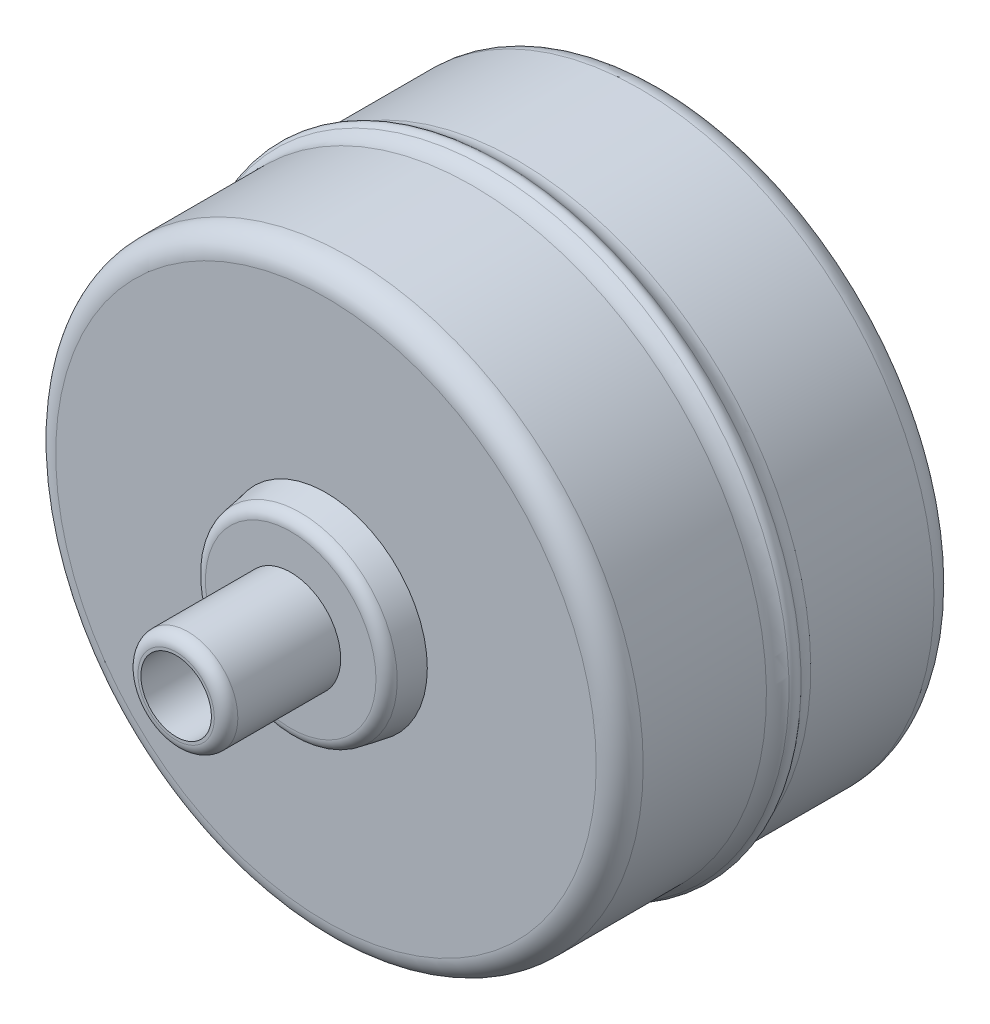
ISO-10303-21;
HEADER;
FILE_DESCRIPTION(('STEP AP214'),'2;1');
FILE_NAME('part.step','',(''),(''),'','','');
FILE_SCHEMA(('AUTOMOTIVE_DESIGN { 1 0 10303 214 1 1 1 1 }'));
ENDSEC;
DATA;
#1=APPLICATION_CONTEXT('core data for automotive mechanical design processes');
#2=APPLICATION_PROTOCOL_DEFINITION('international standard','automotive_design',2000,#1);
#3=PRODUCT_CONTEXT('',#1,'mechanical');
#4=PRODUCT('Part','Part','',(#3));
#5=PRODUCT_RELATED_PRODUCT_CATEGORY('part','',(#4));
#6=PRODUCT_DEFINITION_FORMATION('','',#4);
#7=PRODUCT_DEFINITION_CONTEXT('part definition',#1,'design');
#8=PRODUCT_DEFINITION('design','',#6,#7);
#9=PRODUCT_DEFINITION_SHAPE('','',#8);
#10=(LENGTH_UNIT() NAMED_UNIT(*) SI_UNIT(.MILLI.,.METRE.));
#11=(NAMED_UNIT(*) PLANE_ANGLE_UNIT() SI_UNIT($,.RADIAN.));
#12=(NAMED_UNIT(*) SI_UNIT($,.STERADIAN.) SOLID_ANGLE_UNIT());
#13=UNCERTAINTY_MEASURE_WITH_UNIT(LENGTH_MEASURE(1.E-05),#10,'distance_accuracy_value','');
#14=(GEOMETRIC_REPRESENTATION_CONTEXT(3) GLOBAL_UNCERTAINTY_ASSIGNED_CONTEXT((#13)) GLOBAL_UNIT_ASSIGNED_CONTEXT((#10,
#11,#12)) REPRESENTATION_CONTEXT('',''));
#15=CARTESIAN_POINT('',(0.,0.,0.));
#16=DIRECTION('',(0.,0.,1.));
#17=DIRECTION('',(1.,0.,0.));
#18=AXIS2_PLACEMENT_3D('',#15,#16,#17);
#19=CARTESIAN_POINT('',(0.,0.,4.375));
#20=DIRECTION('',(0.,0.,1.));
#21=DIRECTION('',(1.,0.,0.));
#22=AXIS2_PLACEMENT_3D('',#19,#20,#21);
#23=PLANE('',#22);
#24=CARTESIAN_POINT('',(0.,0.,4.375));
#25=DIRECTION('',(0.,0.,-1.));
#26=DIRECTION('',(-1.,0.,0.));
#27=AXIS2_PLACEMENT_3D('',#24,#25,#26);
#28=CIRCLE('',#27,22.);
#29=CARTESIAN_POINT('',(-22.,0.,4.375));
#30=VERTEX_POINT('',#29);
#31=EDGE_CURVE('E11',#30,#30,#28,.T.);
#32=ORIENTED_EDGE('',*,*,#31,.T.);
#33=EDGE_LOOP('',(#32));
#34=FACE_BOUND('',#33,.T.);
#35=ADVANCED_FACE('F47',(#34),#23,.F.);
#36=CARTESIAN_POINT('',(0.,0.,0.));
#37=DIRECTION('',(0.,0.,-1.));
#38=DIRECTION('',(-1.,0.,0.));
#39=AXIS2_PLACEMENT_3D('',#36,#37,#38);
#40=CYLINDRICAL_SURFACE('',#39,22.);
#41=ORIENTED_EDGE('',*,*,#31,.F.);
#42=EDGE_LOOP('',(#41));
#43=FACE_BOUND('',#42,.T.);
#44=CARTESIAN_POINT('',(0.,0.,24.375));
#45=DIRECTION('',(0.,0.,-1.));
#46=DIRECTION('',(-1.,0.,0.));
#47=AXIS2_PLACEMENT_3D('',#44,#45,#46);
#48=CIRCLE('',#47,22.);
#49=CARTESIAN_POINT('',(-22.,0.,24.375));
#50=VERTEX_POINT('',#49);
#51=EDGE_CURVE('E53',#50,#50,#48,.T.);
#52=ORIENTED_EDGE('',*,*,#51,.T.);
#53=EDGE_LOOP('',(#52));
#54=FACE_BOUND('',#53,.T.);
#55=ADVANCED_FACE('F59',(#43,#54),#40,.T.);
#56=CARTESIAN_POINT('',(22.,0.,24.375));
#57=DIRECTION('',(0.,0.,-1.));
#58=DIRECTION('',(-1.,0.,0.));
#59=AXIS2_PLACEMENT_3D('',#56,#57,#58);
#60=PLANE('',#59);
#61=ORIENTED_EDGE('',*,*,#51,.F.);
#62=EDGE_LOOP('',(#61));
#63=FACE_BOUND('',#62,.T.);
#64=ADVANCED_FACE('F61',(#63),#60,.F.);
#65=CLOSED_SHELL('',(#35,#55,#64));
#66=MANIFOLD_SOLID_BREP('B2',#65);
#67=CARTESIAN_POINT('',(0.,0.,41.5));
#68=DIRECTION('',(0.,0.,-1.));
#69=DIRECTION('',(-1.,0.,0.));
#70=AXIS2_PLACEMENT_3D('',#67,#68,#69);
#71=CYLINDRICAL_SURFACE('',#70,3.);
#72=CARTESIAN_POINT('',(0.,0.,-13.));
#73=DIRECTION('',(0.,0.,-1.));
#74=DIRECTION('',(-1.,0.,0.));
#75=AXIS2_PLACEMENT_3D('',#72,#73,#74);
#76=CIRCLE('',#75,3.);
#77=CARTESIAN_POINT('',(-3.,0.,-13.));
#78=VERTEX_POINT('',#77);
#79=EDGE_CURVE('E187',#78,#78,#76,.T.);
#80=ORIENTED_EDGE('',*,*,#79,.T.);
#81=EDGE_LOOP('',(#80));
#82=FACE_BOUND('',#81,.T.);
#83=CARTESIAN_POINT('',(0.,0.,3.));
#84=DIRECTION('',(0.,0.,1.));
#85=DIRECTION('',(1.,0.,0.));
#86=AXIS2_PLACEMENT_3D('',#83,#84,#85);
#87=CIRCLE('',#86,3.);
#88=CARTESIAN_POINT('',(3.,0.,3.));
#89=VERTEX_POINT('',#88);
#90=EDGE_CURVE('E92',#89,#89,#87,.T.);
#91=ORIENTED_EDGE('',*,*,#90,.T.);
#92=EDGE_LOOP('',(#91));
#93=FACE_BOUND('',#92,.T.);
#94=ADVANCED_FACE('F88',(#82,#93),#71,.F.);
#95=CARTESIAN_POINT('',(0.,0.,41.5));
#96=DIRECTION('',(0.,0.,1.));
#97=DIRECTION('',(1.,0.,0.));
#98=AXIS2_PLACEMENT_3D('',#95,#96,#97);
#99=CIRCLE('',#98,3.);
#100=CARTESIAN_POINT('',(3.,0.,41.5));
#101=VERTEX_POINT('',#100);
#102=EDGE_CURVE('E125',#101,#101,#99,.T.);
#103=ORIENTED_EDGE('',*,*,#102,.T.);
#104=EDGE_LOOP('',(#103));
#105=FACE_BOUND('',#104,.T.);
#106=CARTESIAN_POINT('',(0.,0.,25.75));
#107=DIRECTION('',(0.,0.,-1.));
#108=DIRECTION('',(-1.,0.,0.));
#109=AXIS2_PLACEMENT_3D('',#106,#107,#108);
#110=CIRCLE('',#109,3.);
#111=CARTESIAN_POINT('',(-3.,0.,25.75));
#112=VERTEX_POINT('',#111);
#113=EDGE_CURVE('E162',#112,#112,#110,.T.);
#114=ORIENTED_EDGE('',*,*,#113,.T.);
#115=EDGE_LOOP('',(#114));
#116=FACE_BOUND('',#115,.T.);
#117=ADVANCED_FACE('F214',(#105,#116),#71,.F.);
#118=CARTESIAN_POINT('',(0.,0.,28.75));
#119=DIRECTION('',(0.,0.,-1.));
#120=DIRECTION('',(-1.,0.,0.));
#121=AXIS2_PLACEMENT_3D('',#118,#119,#120);
#122=CYLINDRICAL_SURFACE('',#121,25.);
#123=CARTESIAN_POINT('',(0.,0.,2.));
#124=DIRECTION('',(0.,0.,1.));
#125=DIRECTION('',(1.,0.,0.));
#126=AXIS2_PLACEMENT_3D('',#123,#124,#125);
#127=CIRCLE('',#126,25.);
#128=CARTESIAN_POINT('',(25.,0.,2.));
#129=VERTEX_POINT('',#128);
#130=EDGE_CURVE('E134',#129,#129,#127,.T.);
#131=ORIENTED_EDGE('',*,*,#130,.T.);
#132=EDGE_LOOP('',(#131));
#133=FACE_BOUND('',#132,.T.);
#134=CARTESIAN_POINT('',(0.,0.,12.4875413911823));
#135=DIRECTION('',(0.,0.,-1.));
#136=DIRECTION('',(-1.,0.,0.));
#137=AXIS2_PLACEMENT_3D('',#134,#135,#136);
#138=CIRCLE('',#137,25.);
#139=CARTESIAN_POINT('',(0.,25.,12.4875413911823));
#140=VERTEX_POINT('',#139);
#141=EDGE_CURVE('E118',#140,#140,#138,.T.);
#142=ORIENTED_EDGE('',*,*,#141,.T.);
#143=EDGE_LOOP('',(#142));
#144=FACE_BOUND('',#143,.T.);
#145=ADVANCED_FACE('F220',(#133,#144),#122,.T.);
#146=CARTESIAN_POINT('',(0.,0.,0.));
#147=DIRECTION('',(0.,0.,1.));
#148=DIRECTION('',(1.,0.,0.));
#149=AXIS2_PLACEMENT_3D('',#146,#147,#148);
#150=PLANE('',#149);
#151=CARTESIAN_POINT('',(0.,0.,0.));
#152=DIRECTION('',(0.,0.,1.));
#153=DIRECTION('',(1.,0.,0.));
#154=AXIS2_PLACEMENT_3D('',#151,#152,#153);
#155=CIRCLE('',#154,23.);
#156=CARTESIAN_POINT('',(23.,0.,0.));
#157=VERTEX_POINT('',#156);
#158=EDGE_CURVE('E137',#157,#157,#155,.F.);
#159=ORIENTED_EDGE('',*,*,#158,.T.);
#160=EDGE_LOOP('',(#159));
#161=FACE_BOUND('',#160,.T.);
#162=CARTESIAN_POINT('',(0.,0.,0.));
#163=DIRECTION('',(0.,0.,1.));
#164=DIRECTION('',(1.,0.,0.));
#165=AXIS2_PLACEMENT_3D('',#162,#163,#164);
#166=CIRCLE('',#165,8.625);
#167=CARTESIAN_POINT('',(8.625,0.,0.));
#168=VERTEX_POINT('',#167);
#169=EDGE_CURVE('E131',#168,#168,#166,.F.);
#170=ORIENTED_EDGE('',*,*,#169,.F.);
#171=EDGE_LOOP('',(#170));
#172=FACE_BOUND('',#171,.T.);
#173=ADVANCED_FACE('F238',(#161,#172),#150,.F.);
#174=CARTESIAN_POINT('',(0.,0.,14.375));
#175=DIRECTION('',(0.,0.,-1.));
#176=DIRECTION('',(-1.,0.,0.));
#177=AXIS2_PLACEMENT_3D('',#174,#175,#176);
#178=TOROIDAL_SURFACE('',#177,25.,0.75);
#179=CARTESIAN_POINT('',(0.,25.,14.375));
#180=DIRECTION('',(1.,0.,0.));
#181=DIRECTION('',(0.,0.,-1.));
#182=AXIS2_PLACEMENT_3D('',#179,#180,#181);
#183=CIRCLE('',#182,0.75);
#184=CARTESIAN_POINT('',(0.,25.5454545454545,13.8602385612317));
#185=VERTEX_POINT('',#184);
#186=CARTESIAN_POINT('',(0.,25.5454545454545,14.8897614387683));
#187=VERTEX_POINT('',#186);
#188=EDGE_CURVE('E121',#185,#187,#183,.T.);
#189=ORIENTED_EDGE('',*,*,#188,.F.);
#190=CARTESIAN_POINT('',(0.,0.,13.8602385612317));
#191=DIRECTION('',(0.,0.,1.));
#192=DIRECTION('',(1.,0.,0.));
#193=AXIS2_PLACEMENT_3D('',#190,#191,#192);
#194=CIRCLE('',#193,25.5454545454544);
#195=EDGE_CURVE('E120',#185,#185,#194,.T.);
#196=ORIENTED_EDGE('',*,*,#195,.T.);
#197=ORIENTED_EDGE('',*,*,#188,.T.);
#198=CARTESIAN_POINT('',(0.,0.,14.8897614387683));
#199=DIRECTION('',(0.,0.,-1.));
#200=DIRECTION('',(-1.,0.,0.));
#201=AXIS2_PLACEMENT_3D('',#198,#199,#200);
#202=CIRCLE('',#201,25.5454545454544);
#203=EDGE_CURVE('E193',#187,#187,#202,.T.);
#204=ORIENTED_EDGE('',*,*,#203,.T.);
#205=EDGE_LOOP('',(#189,#196,#197,#204));
#206=FACE_BOUND('',#205,.T.);
#207=ADVANCED_FACE('F234',(#206),#178,.T.);
#208=CARTESIAN_POINT('',(0.,0.,28.75));
#209=DIRECTION('',(0.,0.,1.));
#210=DIRECTION('',(1.,0.,0.));
#211=AXIS2_PLACEMENT_3D('',#208,#209,#210);
#212=PLANE('',#211);
#213=CARTESIAN_POINT('',(0.,0.,28.75));
#214=DIRECTION('',(0.,0.,1.));
#215=DIRECTION('',(1.,0.,0.));
#216=AXIS2_PLACEMENT_3D('',#213,#214,#215);
#217=CIRCLE('',#216,23.);
#218=CARTESIAN_POINT('',(23.,0.,28.75));
#219=VERTEX_POINT('',#218);
#220=EDGE_CURVE('E140',#219,#219,#217,.T.);
#221=ORIENTED_EDGE('',*,*,#220,.T.);
#222=EDGE_LOOP('',(#221));
#223=FACE_BOUND('',#222,.T.);
#224=CARTESIAN_POINT('',(0.,0.,28.75));
#225=DIRECTION('',(0.,0.,1.));
#226=DIRECTION('',(1.,0.,0.));
#227=AXIS2_PLACEMENT_3D('',#224,#225,#226);
#228=CIRCLE('',#227,8.625);
#229=CARTESIAN_POINT('',(8.625,0.,28.75));
#230=VERTEX_POINT('',#229);
#231=EDGE_CURVE('E181',#230,#230,#228,.T.);
#232=ORIENTED_EDGE('',*,*,#231,.F.);
#233=EDGE_LOOP('',(#232));
#234=FACE_BOUND('',#233,.T.);
#235=ADVANCED_FACE('F237',(#223,#234),#212,.T.);
#236=CARTESIAN_POINT('',(0.,0.,26.75));
#237=DIRECTION('',(0.,0.,1.));
#238=DIRECTION('',(1.,0.,0.));
#239=AXIS2_PLACEMENT_3D('',#236,#237,#238);
#240=CIRCLE('',#239,25.);
#241=CARTESIAN_POINT('',(25.,0.,26.75));
#242=VERTEX_POINT('',#241);
#243=EDGE_CURVE('E143',#242,#242,#240,.F.);
#244=ORIENTED_EDGE('',*,*,#243,.T.);
#245=EDGE_LOOP('',(#244));
#246=FACE_BOUND('',#245,.T.);
#247=CARTESIAN_POINT('',(0.,0.,16.2624586088177));
#248=DIRECTION('',(0.,0.,1.));
#249=DIRECTION('',(1.,0.,0.));
#250=AXIS2_PLACEMENT_3D('',#247,#248,#249);
#251=CIRCLE('',#250,25.);
#252=CARTESIAN_POINT('',(0.,25.,16.2624586088177));
#253=VERTEX_POINT('',#252);
#254=EDGE_CURVE('E128',#253,#253,#251,.T.);
#255=ORIENTED_EDGE('',*,*,#254,.T.);
#256=EDGE_LOOP('',(#255));
#257=FACE_BOUND('',#256,.T.);
#258=ADVANCED_FACE('F199',(#246,#257),#122,.T.);
#259=CARTESIAN_POINT('',(0.,0.,12.4875413911823));
#260=DIRECTION('',(0.,0.,-1.));
#261=DIRECTION('',(-1.,0.,0.));
#262=AXIS2_PLACEMENT_3D('',#259,#260,#261);
#263=TOROIDAL_SURFACE('',#262,27.,2.);
#264=CARTESIAN_POINT('',(0.,27.,12.4875413911823));
#265=DIRECTION('',(1.,0.,0.));
#266=DIRECTION('',(0.,0.,-1.));
#267=AXIS2_PLACEMENT_3D('',#264,#265,#266);
#268=CIRCLE('',#267,2.);
#269=EDGE_CURVE('E115',#185,#140,#268,.T.);
#270=ORIENTED_EDGE('',*,*,#269,.F.);
#271=ORIENTED_EDGE('',*,*,#195,.F.);
#272=ORIENTED_EDGE('',*,*,#269,.T.);
#273=ORIENTED_EDGE('',*,*,#141,.F.);
#274=EDGE_LOOP('',(#270,#271,#272,#273));
#275=FACE_BOUND('',#274,.T.);
#276=ADVANCED_FACE('F116',(#275),#263,.F.);
#277=CARTESIAN_POINT('',(0.,0.,16.2624586088177));
#278=DIRECTION('',(0.,0.,1.));
#279=DIRECTION('',(1.,0.,0.));
#280=AXIS2_PLACEMENT_3D('',#277,#278,#279);
#281=TOROIDAL_SURFACE('',#280,27.,2.);
#282=CARTESIAN_POINT('',(0.,27.,16.2624586088177));
#283=DIRECTION('',(-1.,0.,0.));
#284=DIRECTION('',(0.,0.,1.));
#285=AXIS2_PLACEMENT_3D('',#282,#283,#284);
#286=CIRCLE('',#285,2.);
#287=EDGE_CURVE('E105',#187,#253,#286,.T.);
#288=ORIENTED_EDGE('',*,*,#287,.F.);
#289=ORIENTED_EDGE('',*,*,#203,.F.);
#290=ORIENTED_EDGE('',*,*,#287,.T.);
#291=ORIENTED_EDGE('',*,*,#254,.F.);
#292=EDGE_LOOP('',(#288,#289,#290,#291));
#293=FACE_BOUND('',#292,.T.);
#294=ADVANCED_FACE('F200',(#293),#281,.F.);
#295=CARTESIAN_POINT('',(0.,0.,31.75));
#296=DIRECTION('',(0.,0.,1.));
#297=DIRECTION('',(1.,0.,0.));
#298=AXIS2_PLACEMENT_3D('',#295,#296,#297);
#299=PLANE('',#298);
#300=CARTESIAN_POINT('',(0.,0.,31.75));
#301=DIRECTION('',(0.,0.,1.));
#302=DIRECTION('',(1.,0.,0.));
#303=AXIS2_PLACEMENT_3D('',#300,#301,#302);
#304=CIRCLE('',#303,7.25691942669733);
#305=CARTESIAN_POINT('',(7.25691942669733,0.,31.75));
#306=VERTEX_POINT('',#305);
#307=EDGE_CURVE('E97',#306,#306,#304,.T.);
#308=ORIENTED_EDGE('',*,*,#307,.T.);
#309=EDGE_LOOP('',(#308));
#310=FACE_BOUND('',#309,.T.);
#311=CARTESIAN_POINT('',(0.,0.,31.75));
#312=DIRECTION('',(0.,0.,1.));
#313=DIRECTION('',(1.,0.,0.));
#314=AXIS2_PLACEMENT_3D('',#311,#312,#313);
#315=CIRCLE('',#314,4.25);
#316=CARTESIAN_POINT('',(4.25,0.,31.75));
#317=VERTEX_POINT('',#316);
#318=EDGE_CURVE('E184',#317,#317,#315,.T.);
#319=ORIENTED_EDGE('',*,*,#318,.F.);
#320=EDGE_LOOP('',(#319));
#321=FACE_BOUND('',#320,.T.);
#322=ADVANCED_FACE('F202',(#310,#321),#299,.T.);
#323=CARTESIAN_POINT('',(0.,0.,41.5));
#324=DIRECTION('',(0.,0.,-1.));
#325=DIRECTION('',(-1.,0.,0.));
#326=AXIS2_PLACEMENT_3D('',#323,#324,#325);
#327=CYLINDRICAL_SURFACE('',#326,4.25);
#328=CARTESIAN_POINT('',(0.,0.,40.5));
#329=DIRECTION('',(0.,0.,1.));
#330=DIRECTION('',(1.,0.,0.));
#331=AXIS2_PLACEMENT_3D('',#328,#329,#330);
#332=CIRCLE('',#331,4.25);
#333=CARTESIAN_POINT('',(4.25,0.,40.5));
#334=VERTEX_POINT('',#333);
#335=EDGE_CURVE('E158',#334,#334,#332,.F.);
#336=ORIENTED_EDGE('',*,*,#335,.T.);
#337=EDGE_LOOP('',(#336));
#338=FACE_BOUND('',#337,.T.);
#339=ORIENTED_EDGE('',*,*,#318,.T.);
#340=EDGE_LOOP('',(#339));
#341=FACE_BOUND('',#340,.T.);
#342=ADVANCED_FACE('F208',(#338,#341),#327,.T.);
#343=CARTESIAN_POINT('',(0.,0.,41.5));
#344=DIRECTION('',(0.,0.,1.));
#345=DIRECTION('',(1.,0.,0.));
#346=AXIS2_PLACEMENT_3D('',#343,#344,#345);
#347=PLANE('',#346);
#348=CARTESIAN_POINT('',(0.,0.,41.5));
#349=DIRECTION('',(0.,0.,1.));
#350=DIRECTION('',(1.,0.,0.));
#351=AXIS2_PLACEMENT_3D('',#348,#349,#350);
#352=CIRCLE('',#351,3.25);
#353=CARTESIAN_POINT('',(3.25,0.,41.5));
#354=VERTEX_POINT('',#353);
#355=EDGE_CURVE('E155',#354,#354,#352,.T.);
#356=ORIENTED_EDGE('',*,*,#355,.T.);
#357=EDGE_LOOP('',(#356));
#358=FACE_BOUND('',#357,.T.);
#359=ORIENTED_EDGE('',*,*,#102,.F.);
#360=EDGE_LOOP('',(#359));
#361=FACE_BOUND('',#360,.T.);
#362=ADVANCED_FACE('F226',(#358,#361),#347,.T.);
#363=CARTESIAN_POINT('',(0.,0.,31.75));
#364=DIRECTION('',(0.,0.,-1.));
#365=DIRECTION('',(-1.,0.,0.));
#366=AXIS2_PLACEMENT_3D('',#363,#364,#365);
#367=CONICAL_SURFACE('',#366,8.09601905787461,0.174532925199431);
#368=CARTESIAN_POINT('',(0.,0.,30.9236481776669));
#369=DIRECTION('',(0.,0.,1.));
#370=DIRECTION('',(1.,0.,0.));
#371=AXIS2_PLACEMENT_3D('',#368,#369,#370);
#372=CIRCLE('',#371,8.24172717970954);
#373=CARTESIAN_POINT('',(8.24172717970954,0.,30.9236481776669));
#374=VERTEX_POINT('',#373);
#375=EDGE_CURVE('E45',#374,#374,#372,.F.);
#376=ORIENTED_EDGE('',*,*,#375,.T.);
#377=EDGE_LOOP('',(#376));
#378=FACE_BOUND('',#377,.T.);
#379=ORIENTED_EDGE('',*,*,#231,.T.);
#380=EDGE_LOOP('',(#379));
#381=FACE_BOUND('',#380,.T.);
#382=ADVANCED_FACE('F229',(#378,#381),#367,.T.);
#383=CARTESIAN_POINT('',(0.,0.,-3.));
#384=DIRECTION('',(0.,0.,-1.));
#385=DIRECTION('',(-1.,0.,0.));
#386=AXIS2_PLACEMENT_3D('',#383,#384,#385);
#387=PLANE('',#386);
#388=CARTESIAN_POINT('',(0.,0.,-3.));
#389=DIRECTION('',(0.,0.,-1.));
#390=DIRECTION('',(-1.,0.,0.));
#391=AXIS2_PLACEMENT_3D('',#388,#389,#390);
#392=CIRCLE('',#391,7.25691942669733);
#393=CARTESIAN_POINT('',(-7.25691942669733,0.,-3.));
#394=VERTEX_POINT('',#393);
#395=EDGE_CURVE('E146',#394,#394,#392,.T.);
#396=ORIENTED_EDGE('',*,*,#395,.T.);
#397=EDGE_LOOP('',(#396));
#398=FACE_BOUND('',#397,.T.);
#399=CARTESIAN_POINT('',(0.,0.,-3.));
#400=DIRECTION('',(0.,0.,-1.));
#401=DIRECTION('',(-1.,0.,0.));
#402=AXIS2_PLACEMENT_3D('',#399,#400,#401);
#403=CIRCLE('',#402,4.);
#404=CARTESIAN_POINT('',(4.,0.,-3.));
#405=VERTEX_POINT('',#404);
#406=EDGE_CURVE('E168',#405,#405,#403,.T.);
#407=ORIENTED_EDGE('',*,*,#406,.F.);
#408=EDGE_LOOP('',(#407));
#409=FACE_BOUND('',#408,.T.);
#410=ADVANCED_FACE('F307',(#398,#409),#387,.T.);
#411=CARTESIAN_POINT('',(0.,0.,-13.));
#412=DIRECTION('',(0.,0.,1.));
#413=DIRECTION('',(1.,0.,0.));
#414=AXIS2_PLACEMENT_3D('',#411,#412,#413);
#415=CYLINDRICAL_SURFACE('',#414,4.);
#416=CARTESIAN_POINT('',(0.,0.,-12.));
#417=DIRECTION('',(0.,0.,-1.));
#418=DIRECTION('',(-1.,0.,0.));
#419=AXIS2_PLACEMENT_3D('',#416,#417,#418);
#420=CIRCLE('',#419,4.);
#421=CARTESIAN_POINT('',(4.,0.,-12.));
#422=VERTEX_POINT('',#421);
#423=EDGE_CURVE('E152',#422,#422,#420,.F.);
#424=CARTESIAN_POINT('',(4.,0.,-12.));
#425=CARTESIAN_POINT('',(4.,0.,-11.90625));
#426=CARTESIAN_POINT('',(4.,0.,-11.8125));
#427=CARTESIAN_POINT('',(4.,0.,-11.625));
#428=CARTESIAN_POINT('',(4.,0.,-11.53125));
#429=CARTESIAN_POINT('',(4.,0.,-11.34375));
#430=CARTESIAN_POINT('',(4.,0.,-11.25));
#431=CARTESIAN_POINT('',(4.,0.,-11.0625));
#432=CARTESIAN_POINT('',(4.,0.,-10.96875));
#433=CARTESIAN_POINT('',(4.,0.,-10.78125));
#434=CARTESIAN_POINT('',(4.,0.,-10.6875));
#435=CARTESIAN_POINT('',(4.,0.,-10.5));
#436=CARTESIAN_POINT('',(4.,0.,-10.40625));
#437=CARTESIAN_POINT('',(4.,0.,-10.21875));
#438=CARTESIAN_POINT('',(4.,0.,-10.125));
#439=CARTESIAN_POINT('',(4.,0.,-9.9375));
#440=CARTESIAN_POINT('',(4.,0.,-9.84375));
#441=CARTESIAN_POINT('',(4.,0.,-9.65625));
#442=CARTESIAN_POINT('',(4.,0.,-9.5625));
#443=CARTESIAN_POINT('',(4.,0.,-9.375));
#444=CARTESIAN_POINT('',(4.,0.,-9.28125));
#445=CARTESIAN_POINT('',(4.,0.,-9.09375));
#446=CARTESIAN_POINT('',(4.,0.,-9.));
#447=CARTESIAN_POINT('',(4.,0.,-8.8125));
#448=CARTESIAN_POINT('',(4.,0.,-8.71875));
#449=CARTESIAN_POINT('',(4.,0.,-8.53125));
#450=CARTESIAN_POINT('',(4.,0.,-8.4375));
#451=CARTESIAN_POINT('',(4.,0.,-8.25));
#452=CARTESIAN_POINT('',(4.,0.,-8.15625));
#453=CARTESIAN_POINT('',(4.,0.,-7.96875));
#454=CARTESIAN_POINT('',(4.,0.,-7.875));
#455=CARTESIAN_POINT('',(4.,0.,-7.6875));
#456=CARTESIAN_POINT('',(4.,0.,-7.59375));
#457=CARTESIAN_POINT('',(4.,0.,-7.40625));
#458=CARTESIAN_POINT('',(4.,0.,-7.3125));
#459=CARTESIAN_POINT('',(4.,0.,-7.125));
#460=CARTESIAN_POINT('',(4.,0.,-7.03125));
#461=CARTESIAN_POINT('',(4.,0.,-6.84375));
#462=CARTESIAN_POINT('',(4.,0.,-6.75));
#463=CARTESIAN_POINT('',(4.,0.,-6.5625));
#464=CARTESIAN_POINT('',(4.,0.,-6.46875));
#465=CARTESIAN_POINT('',(4.,0.,-6.28125));
#466=CARTESIAN_POINT('',(4.,0.,-6.1875));
#467=CARTESIAN_POINT('',(4.,0.,-6.));
#468=CARTESIAN_POINT('',(4.,0.,-5.90625));
#469=CARTESIAN_POINT('',(4.,0.,-5.71875));
#470=CARTESIAN_POINT('',(4.,0.,-5.625));
#471=CARTESIAN_POINT('',(4.,0.,-5.4375));
#472=CARTESIAN_POINT('',(4.,0.,-5.34375));
#473=CARTESIAN_POINT('',(4.,0.,-5.15625));
#474=CARTESIAN_POINT('',(4.,0.,-5.0625));
#475=CARTESIAN_POINT('',(4.,0.,-4.875));
#476=CARTESIAN_POINT('',(4.,0.,-4.78125));
#477=CARTESIAN_POINT('',(4.,0.,-4.59375));
#478=CARTESIAN_POINT('',(4.,0.,-4.5));
#479=CARTESIAN_POINT('',(4.,0.,-4.3125));
#480=CARTESIAN_POINT('',(4.,0.,-4.21875));
#481=CARTESIAN_POINT('',(4.,0.,-4.03125));
#482=CARTESIAN_POINT('',(4.,0.,-3.9375));
#483=CARTESIAN_POINT('',(4.,0.,-3.75));
#484=CARTESIAN_POINT('',(4.,0.,-3.65625));
#485=CARTESIAN_POINT('',(4.,0.,-3.46875));
#486=CARTESIAN_POINT('',(4.,0.,-3.375));
#487=CARTESIAN_POINT('',(4.,0.,-3.1875));
#488=CARTESIAN_POINT('',(4.,0.,-3.09375));
#489=CARTESIAN_POINT('',(4.,0.,-3.));
#490=B_SPLINE_CURVE_WITH_KNOTS('',3,(#424,#425,#426,#427,#428,#429,#430,#431,#432,#433,#434,
#435,#436,#437,#438,#439,#440,#441,#442,#443,#444,#445,#446,#447,#448,#449,#450,#451,#452,#453,
#454,#455,#456,#457,#458,#459,#460,#461,#462,#463,#464,#465,#466,#467,#468,#469,#470,#471,#472,
#473,#474,#475,#476,#477,#478,#479,#480,#481,#482,#483,#484,#485,#486,#487,#488,#489),
.UNSPECIFIED.,.F.,.F.,(4,2,2,2,2,2,2,2,2,2,2,2,2,2,2,2,2,2,2,2,2,2,2,2,2,2,2,2,2,2,2,2,4),(0.,
0.281249999999999,0.562499999999999,0.843749999999999,1.125,1.40625,1.6875,1.96875,2.25,2.53125,
2.8125,3.09375,3.375,3.65625,3.9375,4.21875,4.5,4.78125,5.0625,5.34375,5.625,5.90625,6.1875,
6.46875,6.75,7.03125,7.3125,7.59375,7.875,8.15625,8.4375,8.71875,9.),.UNSPECIFIED.);
#491=EDGE_CURVE('BSEAM225',#422,#405,#490,.T.);
#492=ORIENTED_EDGE('',*,*,#423,.T.);
#493=ORIENTED_EDGE('',*,*,#406,.T.);
#494=ORIENTED_EDGE('',*,*,#491,.T.);
#495=ORIENTED_EDGE('',*,*,#491,.F.);
#496=EDGE_LOOP('',(#492,#494,#493,#495));
#497=FACE_BOUND('',#496,.T.);
#498=ADVANCED_FACE('F225',(#497),#415,.T.);
#499=CARTESIAN_POINT('',(0.,0.,-3.));
#500=DIRECTION('',(0.,0.,1.));
#501=DIRECTION('',(1.,0.,0.));
#502=AXIS2_PLACEMENT_3D('',#499,#500,#501);
#503=CONICAL_SURFACE('',#502,8.09601905787461,0.17453292519943);
#504=CARTESIAN_POINT('',(0.,0.,-2.17364817766692));
#505=DIRECTION('',(0.,0.,-1.));
#506=DIRECTION('',(-1.,0.,0.));
#507=AXIS2_PLACEMENT_3D('',#504,#505,#506);
#508=CIRCLE('',#507,8.24172717970954);
#509=CARTESIAN_POINT('',(-8.24172717970954,0.,-2.17364817766692));
#510=VERTEX_POINT('',#509);
#511=EDGE_CURVE('E149',#510,#510,#508,.F.);
#512=ORIENTED_EDGE('',*,*,#511,.T.);
#513=EDGE_LOOP('',(#512));
#514=FACE_BOUND('',#513,.T.);
#515=ORIENTED_EDGE('',*,*,#169,.T.);
#516=EDGE_LOOP('',(#515));
#517=FACE_BOUND('',#516,.T.);
#518=ADVANCED_FACE('F259',(#514,#517),#503,.T.);
#519=CARTESIAN_POINT('',(0.,0.,2.));
#520=DIRECTION('',(0.,0.,1.));
#521=DIRECTION('',(1.,0.,0.));
#522=AXIS2_PLACEMENT_3D('',#519,#520,#521);
#523=TOROIDAL_SURFACE('',#522,23.,2.);
#524=ORIENTED_EDGE('',*,*,#158,.F.);
#525=EDGE_LOOP('',(#524));
#526=FACE_BOUND('',#525,.T.);
#527=ORIENTED_EDGE('',*,*,#130,.F.);
#528=EDGE_LOOP('',(#527));
#529=FACE_BOUND('',#528,.T.);
#530=ADVANCED_FACE('F256',(#526,#529),#523,.T.);
#531=CARTESIAN_POINT('',(0.,0.,26.75));
#532=DIRECTION('',(0.,0.,1.));
#533=DIRECTION('',(1.,0.,0.));
#534=AXIS2_PLACEMENT_3D('',#531,#532,#533);
#535=TOROIDAL_SURFACE('',#534,23.,2.);
#536=ORIENTED_EDGE('',*,*,#243,.F.);
#537=EDGE_LOOP('',(#536));
#538=FACE_BOUND('',#537,.T.);
#539=ORIENTED_EDGE('',*,*,#220,.F.);
#540=EDGE_LOOP('',(#539));
#541=FACE_BOUND('',#540,.T.);
#542=ADVANCED_FACE('F258',(#538,#541),#535,.T.);
#543=CARTESIAN_POINT('',(0.,0.,-2.));
#544=DIRECTION('',(0.,0.,-1.));
#545=DIRECTION('',(-1.,0.,0.));
#546=AXIS2_PLACEMENT_3D('',#543,#544,#545);
#547=TOROIDAL_SURFACE('',#546,7.25691942669733,1.);
#548=ORIENTED_EDGE('',*,*,#511,.F.);
#549=EDGE_LOOP('',(#548));
#550=FACE_BOUND('',#549,.T.);
#551=ORIENTED_EDGE('',*,*,#395,.F.);
#552=EDGE_LOOP('',(#551));
#553=FACE_BOUND('',#552,.T.);
#554=ADVANCED_FACE('F266',(#550,#553),#547,.T.);
#555=CARTESIAN_POINT('',(0.,0.,-12.));
#556=DIRECTION('',(0.,0.,-1.));
#557=DIRECTION('',(-1.,0.,0.));
#558=AXIS2_PLACEMENT_3D('',#555,#556,#557);
#559=TOROIDAL_SURFACE('',#558,3.,1.);
#560=ORIENTED_EDGE('',*,*,#423,.F.);
#561=EDGE_LOOP('',(#560));
#562=FACE_BOUND('',#561,.T.);
#563=ORIENTED_EDGE('',*,*,#79,.F.);
#564=EDGE_LOOP('',(#563));
#565=FACE_BOUND('',#564,.T.);
#566=ADVANCED_FACE('F275',(#562,#565),#559,.T.);
#567=CARTESIAN_POINT('',(0.,0.,40.5));
#568=DIRECTION('',(0.,0.,1.));
#569=DIRECTION('',(1.,0.,0.));
#570=AXIS2_PLACEMENT_3D('',#567,#568,#569);
#571=TOROIDAL_SURFACE('',#570,3.25,1.);
#572=ORIENTED_EDGE('',*,*,#335,.F.);
#573=EDGE_LOOP('',(#572));
#574=FACE_BOUND('',#573,.T.);
#575=ORIENTED_EDGE('',*,*,#355,.F.);
#576=EDGE_LOOP('',(#575));
#577=FACE_BOUND('',#576,.T.);
#578=ADVANCED_FACE('F278',(#574,#577),#571,.T.);
#579=CARTESIAN_POINT('',(0.,0.,30.75));
#580=DIRECTION('',(0.,0.,1.));
#581=DIRECTION('',(1.,0.,0.));
#582=AXIS2_PLACEMENT_3D('',#579,#580,#581);
#583=TOROIDAL_SURFACE('',#582,7.25691942669733,1.);
#584=ORIENTED_EDGE('',*,*,#375,.F.);
#585=EDGE_LOOP('',(#584));
#586=FACE_BOUND('',#585,.T.);
#587=ORIENTED_EDGE('',*,*,#307,.F.);
#588=EDGE_LOOP('',(#587));
#589=FACE_BOUND('',#588,.T.);
#590=ADVANCED_FACE('F90',(#586,#589),#583,.T.);
#591=CARTESIAN_POINT('',(0.,0.,3.));
#592=DIRECTION('',(0.,0.,1.));
#593=DIRECTION('',(1.,0.,0.));
#594=AXIS2_PLACEMENT_3D('',#591,#592,#593);
#595=PLANE('',#594);
#596=ORIENTED_EDGE('',*,*,#90,.F.);
#597=EDGE_LOOP('',(#596));
#598=FACE_BOUND('',#597,.T.);
#599=CARTESIAN_POINT('',(0.,0.,3.));
#600=DIRECTION('',(0.,0.,-1.));
#601=DIRECTION('',(-1.,0.,0.));
#602=AXIS2_PLACEMENT_3D('',#599,#600,#601);
#603=CIRCLE('',#602,21.);
#604=CARTESIAN_POINT('',(-21.,0.,3.));
#605=VERTEX_POINT('',#604);
#606=EDGE_CURVE('E164',#605,#605,#603,.T.);
#607=ORIENTED_EDGE('',*,*,#606,.F.);
#608=EDGE_LOOP('',(#607));
#609=FACE_BOUND('',#608,.T.);
#610=ADVANCED_FACE('F285',(#598,#609),#595,.T.);
#611=CARTESIAN_POINT('',(0.,0.,5.));
#612=DIRECTION('',(0.,0.,-1.));
#613=DIRECTION('',(-1.,0.,0.));
#614=AXIS2_PLACEMENT_3D('',#611,#612,#613);
#615=TOROIDAL_SURFACE('',#614,21.,2.);
#616=ORIENTED_EDGE('',*,*,#606,.T.);
#617=EDGE_LOOP('',(#616));
#618=FACE_BOUND('',#617,.T.);
#619=CARTESIAN_POINT('',(0.,0.,5.00000000000002));
#620=DIRECTION('',(0.,0.,-1.));
#621=DIRECTION('',(-1.,0.,0.));
#622=AXIS2_PLACEMENT_3D('',#619,#620,#621);
#623=CIRCLE('',#622,23.);
#624=CARTESIAN_POINT('',(-23.,0.,5.00000000000002));
#625=VERTEX_POINT('',#624);
#626=EDGE_CURVE('E170',#625,#625,#623,.T.);
#627=ORIENTED_EDGE('',*,*,#626,.F.);
#628=EDGE_LOOP('',(#627));
#629=FACE_BOUND('',#628,.T.);
#630=ADVANCED_FACE('F298',(#618,#629),#615,.F.);
#631=CARTESIAN_POINT('',(0.,0.,0.));
#632=DIRECTION('',(0.,0.,-1.));
#633=DIRECTION('',(-1.,0.,0.));
#634=AXIS2_PLACEMENT_3D('',#631,#632,#633);
#635=CYLINDRICAL_SURFACE('',#634,23.);
#636=ORIENTED_EDGE('',*,*,#626,.T.);
#637=EDGE_LOOP('',(#636));
#638=FACE_BOUND('',#637,.T.);
#639=CARTESIAN_POINT('',(0.,0.,23.75));
#640=DIRECTION('',(0.,0.,-1.));
#641=DIRECTION('',(-1.,0.,0.));
#642=AXIS2_PLACEMENT_3D('',#639,#640,#641);
#643=CIRCLE('',#642,23.);
#644=CARTESIAN_POINT('',(-23.,0.,23.75));
#645=VERTEX_POINT('',#644);
#646=EDGE_CURVE('E175',#645,#645,#643,.T.);
#647=ORIENTED_EDGE('',*,*,#646,.F.);
#648=EDGE_LOOP('',(#647));
#649=FACE_BOUND('',#648,.T.);
#650=ADVANCED_FACE('F323',(#638,#649),#635,.F.);
#651=CARTESIAN_POINT('',(0.,0.,23.75));
#652=DIRECTION('',(0.,0.,-1.));
#653=DIRECTION('',(-1.,0.,0.));
#654=AXIS2_PLACEMENT_3D('',#651,#652,#653);
#655=TOROIDAL_SURFACE('',#654,21.,2.);
#656=ORIENTED_EDGE('',*,*,#646,.T.);
#657=EDGE_LOOP('',(#656));
#658=FACE_BOUND('',#657,.T.);
#659=CARTESIAN_POINT('',(0.,0.,25.75));
#660=DIRECTION('',(0.,0.,-1.));
#661=DIRECTION('',(-1.,0.,0.));
#662=AXIS2_PLACEMENT_3D('',#659,#660,#661);
#663=CIRCLE('',#662,21.);
#664=CARTESIAN_POINT('',(-21.,0.,25.75));
#665=VERTEX_POINT('',#664);
#666=EDGE_CURVE('E339',#665,#665,#663,.T.);
#667=ORIENTED_EDGE('',*,*,#666,.F.);
#668=EDGE_LOOP('',(#667));
#669=FACE_BOUND('',#668,.T.);
#670=ADVANCED_FACE('F326',(#658,#669),#655,.F.);
#671=CARTESIAN_POINT('',(21.,0.,25.75));
#672=DIRECTION('',(0.,0.,-1.));
#673=DIRECTION('',(-1.,0.,0.));
#674=AXIS2_PLACEMENT_3D('',#671,#672,#673);
#675=PLANE('',#674);
#676=ORIENTED_EDGE('',*,*,#113,.F.);
#677=EDGE_LOOP('',(#676));
#678=FACE_BOUND('',#677,.T.);
#679=ORIENTED_EDGE('',*,*,#666,.T.);
#680=EDGE_LOOP('',(#679));
#681=FACE_BOUND('',#680,.T.);
#682=ADVANCED_FACE('F330',(#678,#681),#675,.T.);
#683=CLOSED_SHELL('',(#94,#117,#145,#173,#207,#235,#258,#276,#294,#322,#342,#362,#382,#410,#498,
#518,#530,#542,#554,#566,#578,#590,#610,#630,#650,#670,#682));
#684=MANIFOLD_SOLID_BREP('B6',#683);
#685=ADVANCED_BREP_SHAPE_REPRESENTATION('',(#18,#66,#684),#14);
#686=SHAPE_DEFINITION_REPRESENTATION(#9,#685);
ENDSEC;
END-ISO-10303-21;
